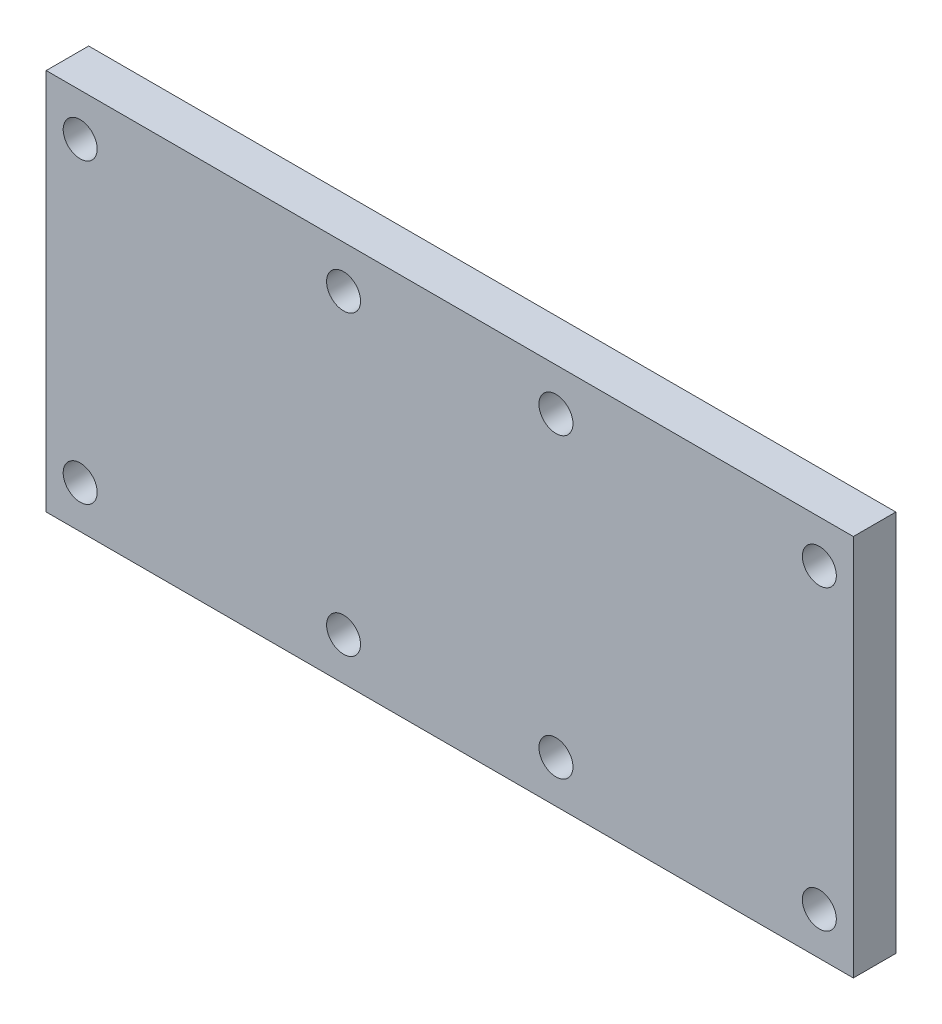
ISO-10303-21;
HEADER;
FILE_DESCRIPTION(('STEP AP214'),'2;1');
FILE_NAME('part.step','',(''),(''),'','','');
FILE_SCHEMA(('AUTOMOTIVE_DESIGN { 1 0 10303 214 1 1 1 1 }'));
ENDSEC;
DATA;
#1=APPLICATION_CONTEXT('core data for automotive mechanical design processes');
#2=APPLICATION_PROTOCOL_DEFINITION('international standard','automotive_design',2000,#1);
#3=PRODUCT_CONTEXT('',#1,'mechanical');
#4=PRODUCT('Part','Part','',(#3));
#5=PRODUCT_RELATED_PRODUCT_CATEGORY('part','',(#4));
#6=PRODUCT_DEFINITION_FORMATION('','',#4);
#7=PRODUCT_DEFINITION_CONTEXT('part definition',#1,'design');
#8=PRODUCT_DEFINITION('design','',#6,#7);
#9=PRODUCT_DEFINITION_SHAPE('','',#8);
#10=(LENGTH_UNIT() NAMED_UNIT(*) SI_UNIT(.MILLI.,.METRE.));
#11=(NAMED_UNIT(*) PLANE_ANGLE_UNIT() SI_UNIT($,.RADIAN.));
#12=(NAMED_UNIT(*) SI_UNIT($,.STERADIAN.) SOLID_ANGLE_UNIT());
#13=UNCERTAINTY_MEASURE_WITH_UNIT(LENGTH_MEASURE(1.E-05),#10,'distance_accuracy_value','');
#14=(GEOMETRIC_REPRESENTATION_CONTEXT(3) GLOBAL_UNCERTAINTY_ASSIGNED_CONTEXT((#13)) GLOBAL_UNIT_ASSIGNED_CONTEXT((#10,
#11,#12)) REPRESENTATION_CONTEXT('',''));
#15=CARTESIAN_POINT('',(0.,0.,0.));
#16=DIRECTION('',(0.,0.,1.));
#17=DIRECTION('',(1.,0.,0.));
#18=AXIS2_PLACEMENT_3D('',#15,#16,#17);
#19=CARTESIAN_POINT('',(47.5,22.5,5.));
#20=DIRECTION('',(-1.,0.,0.));
#21=DIRECTION('',(0.,-1.,0.));
#22=AXIS2_PLACEMENT_3D('',#19,#20,#21);
#23=PLANE('',#22);
#24=DIRECTION('',(0.,1.,0.));
#25=VECTOR('',#24,1.);
#26=CARTESIAN_POINT('',(47.5,22.5,0.));
#27=LINE('',#26,#25);
#28=CARTESIAN_POINT('',(47.5,-22.5,0.));
#29=VERTEX_POINT('',#28);
#30=CARTESIAN_POINT('',(47.5,22.5,0.));
#31=VERTEX_POINT('',#30);
#32=EDGE_CURVE('E97',#29,#31,#27,.T.);
#33=ORIENTED_EDGE('',*,*,#32,.T.);
#34=DIRECTION('',(0.,0.,-1.));
#35=VECTOR('',#34,1.);
#36=CARTESIAN_POINT('',(47.5,22.5,5.));
#37=LINE('',#36,#35);
#38=CARTESIAN_POINT('',(47.5,22.5,5.));
#39=VERTEX_POINT('',#38);
#40=EDGE_CURVE('E11',#39,#31,#37,.T.);
#41=ORIENTED_EDGE('',*,*,#40,.F.);
#42=DIRECTION('',(0.,1.,0.));
#43=VECTOR('',#42,1.);
#44=CARTESIAN_POINT('',(47.5,22.5,5.));
#45=LINE('',#44,#43);
#46=CARTESIAN_POINT('',(47.5,-22.5,5.));
#47=VERTEX_POINT('',#46);
#48=EDGE_CURVE('E85',#47,#39,#45,.T.);
#49=ORIENTED_EDGE('',*,*,#48,.F.);
#50=DIRECTION('',(0.,0.,-1.));
#51=VECTOR('',#50,1.);
#52=CARTESIAN_POINT('',(47.5,-22.5,5.));
#53=LINE('',#52,#51);
#54=EDGE_CURVE('E93',#47,#29,#53,.T.);
#55=ORIENTED_EDGE('',*,*,#54,.T.);
#56=EDGE_LOOP('',(#33,#41,#49,#55));
#57=FACE_BOUND('',#56,.T.);
#58=ADVANCED_FACE('F34',(#57),#23,.F.);
#59=CARTESIAN_POINT('',(-47.5,22.5,5.));
#60=DIRECTION('',(0.,-1.,0.));
#61=DIRECTION('',(0.,0.,-1.));
#62=AXIS2_PLACEMENT_3D('',#59,#60,#61);
#63=PLANE('',#62);
#64=DIRECTION('',(-1.,0.,0.));
#65=VECTOR('',#64,1.);
#66=CARTESIAN_POINT('',(-47.5,22.5,0.));
#67=LINE('',#66,#65);
#68=CARTESIAN_POINT('',(-47.5,22.5,0.));
#69=VERTEX_POINT('',#68);
#70=EDGE_CURVE('E89',#31,#69,#67,.T.);
#71=ORIENTED_EDGE('',*,*,#70,.T.);
#72=DIRECTION('',(0.,0.,-1.));
#73=VECTOR('',#72,1.);
#74=CARTESIAN_POINT('',(-47.5,22.5,5.));
#75=LINE('',#74,#73);
#76=CARTESIAN_POINT('',(-47.5,22.5,5.));
#77=VERTEX_POINT('',#76);
#78=EDGE_CURVE('E42',#77,#69,#75,.T.);
#79=ORIENTED_EDGE('',*,*,#78,.F.);
#80=DIRECTION('',(-1.,0.,0.));
#81=VECTOR('',#80,1.);
#82=CARTESIAN_POINT('',(-47.5,22.5,5.));
#83=LINE('',#82,#81);
#84=EDGE_CURVE('E80',#39,#77,#83,.T.);
#85=ORIENTED_EDGE('',*,*,#84,.F.);
#86=ORIENTED_EDGE('',*,*,#40,.T.);
#87=EDGE_LOOP('',(#71,#79,#85,#86));
#88=FACE_BOUND('',#87,.T.);
#89=ADVANCED_FACE('F88',(#88),#63,.F.);
#90=CARTESIAN_POINT('',(-47.5,22.5,5.));
#91=DIRECTION('',(1.,0.,0.));
#92=DIRECTION('',(0.,1.,0.));
#93=AXIS2_PLACEMENT_3D('',#90,#91,#92);
#94=PLANE('',#93);
#95=DIRECTION('',(0.,-1.,0.));
#96=VECTOR('',#95,1.);
#97=CARTESIAN_POINT('',(-47.5,22.5,0.));
#98=LINE('',#97,#96);
#99=CARTESIAN_POINT('',(-47.5,-22.5,0.));
#100=VERTEX_POINT('',#99);
#101=EDGE_CURVE('E67',#69,#100,#98,.T.);
#102=ORIENTED_EDGE('',*,*,#101,.T.);
#103=DIRECTION('',(0.,0.,-1.));
#104=VECTOR('',#103,1.);
#105=CARTESIAN_POINT('',(-47.5,-22.5,5.));
#106=LINE('',#105,#104);
#107=CARTESIAN_POINT('',(-47.5,-22.5,5.));
#108=VERTEX_POINT('',#107);
#109=EDGE_CURVE('E90',#108,#100,#106,.T.);
#110=ORIENTED_EDGE('',*,*,#109,.F.);
#111=DIRECTION('',(0.,-1.,0.));
#112=VECTOR('',#111,1.);
#113=CARTESIAN_POINT('',(-47.5,22.5,5.));
#114=LINE('',#113,#112);
#115=EDGE_CURVE('E83',#77,#108,#114,.T.);
#116=ORIENTED_EDGE('',*,*,#115,.F.);
#117=ORIENTED_EDGE('',*,*,#78,.T.);
#118=EDGE_LOOP('',(#102,#110,#116,#117));
#119=FACE_BOUND('',#118,.T.);
#120=ADVANCED_FACE('F91',(#119),#94,.F.);
#121=CARTESIAN_POINT('',(-47.5,-22.5,5.));
#122=DIRECTION('',(0.,1.,0.));
#123=DIRECTION('',(0.,0.,1.));
#124=AXIS2_PLACEMENT_3D('',#121,#122,#123);
#125=PLANE('',#124);
#126=DIRECTION('',(1.,0.,0.));
#127=VECTOR('',#126,1.);
#128=CARTESIAN_POINT('',(-47.5,-22.5,0.));
#129=LINE('',#128,#127);
#130=EDGE_CURVE('E73',#100,#29,#129,.T.);
#131=ORIENTED_EDGE('',*,*,#130,.T.);
#132=ORIENTED_EDGE('',*,*,#54,.F.);
#133=DIRECTION('',(1.,0.,0.));
#134=VECTOR('',#133,1.);
#135=CARTESIAN_POINT('',(-47.5,-22.5,5.));
#136=LINE('',#135,#134);
#137=EDGE_CURVE('E50',#108,#47,#136,.T.);
#138=ORIENTED_EDGE('',*,*,#137,.F.);
#139=ORIENTED_EDGE('',*,*,#109,.T.);
#140=EDGE_LOOP('',(#131,#132,#138,#139));
#141=FACE_BOUND('',#140,.T.);
#142=ADVANCED_FACE('F105',(#141),#125,.F.);
#143=CARTESIAN_POINT('',(0.,0.,5.));
#144=DIRECTION('',(0.,0.,1.));
#145=DIRECTION('',(1.,0.,0.));
#146=AXIS2_PLACEMENT_3D('',#143,#144,#145);
#147=PLANE('',#146);
#148=CARTESIAN_POINT('',(43.5,-17.5,5.));
#149=DIRECTION('',(0.,0.,1.));
#150=DIRECTION('',(1.,0.,0.));
#151=AXIS2_PLACEMENT_3D('',#148,#149,#150);
#152=CIRCLE('',#151,2.00000000000001);
#153=CARTESIAN_POINT('',(45.5,-17.5,5.));
#154=VERTEX_POINT('',#153);
#155=EDGE_CURVE('E136',#154,#154,#152,.T.);
#156=ORIENTED_EDGE('',*,*,#155,.F.);
#157=EDGE_LOOP('',(#156));
#158=FACE_BOUND('',#157,.T.);
#159=CARTESIAN_POINT('',(12.5,-17.5,5.));
#160=DIRECTION('',(0.,0.,1.));
#161=DIRECTION('',(1.,0.,0.));
#162=AXIS2_PLACEMENT_3D('',#159,#160,#161);
#163=CIRCLE('',#162,2.);
#164=CARTESIAN_POINT('',(14.5,-17.5,5.));
#165=VERTEX_POINT('',#164);
#166=EDGE_CURVE('E130',#165,#165,#163,.T.);
#167=ORIENTED_EDGE('',*,*,#166,.F.);
#168=EDGE_LOOP('',(#167));
#169=FACE_BOUND('',#168,.T.);
#170=CARTESIAN_POINT('',(12.5,17.5,5.));
#171=DIRECTION('',(0.,0.,1.));
#172=DIRECTION('',(1.,0.,0.));
#173=AXIS2_PLACEMENT_3D('',#170,#171,#172);
#174=CIRCLE('',#173,2.00000000000001);
#175=CARTESIAN_POINT('',(14.5,17.5,5.));
#176=VERTEX_POINT('',#175);
#177=EDGE_CURVE('E124',#176,#176,#174,.T.);
#178=ORIENTED_EDGE('',*,*,#177,.F.);
#179=EDGE_LOOP('',(#178));
#180=FACE_BOUND('',#179,.T.);
#181=CARTESIAN_POINT('',(-12.5,17.5,5.));
#182=DIRECTION('',(0.,0.,1.));
#183=DIRECTION('',(1.,0.,0.));
#184=AXIS2_PLACEMENT_3D('',#181,#182,#183);
#185=CIRCLE('',#184,2.);
#186=CARTESIAN_POINT('',(-10.5,17.5,5.));
#187=VERTEX_POINT('',#186);
#188=EDGE_CURVE('E117',#187,#187,#185,.T.);
#189=ORIENTED_EDGE('',*,*,#188,.F.);
#190=EDGE_LOOP('',(#189));
#191=FACE_BOUND('',#190,.T.);
#192=CARTESIAN_POINT('',(-12.5,-17.5,5.));
#193=DIRECTION('',(0.,0.,1.));
#194=DIRECTION('',(1.,0.,0.));
#195=AXIS2_PLACEMENT_3D('',#192,#193,#194);
#196=CIRCLE('',#195,2.);
#197=CARTESIAN_POINT('',(-10.5,-17.5,5.));
#198=VERTEX_POINT('',#197);
#199=EDGE_CURVE('E153',#198,#198,#196,.T.);
#200=ORIENTED_EDGE('',*,*,#199,.F.);
#201=EDGE_LOOP('',(#200));
#202=FACE_BOUND('',#201,.T.);
#203=CARTESIAN_POINT('',(-43.5,-17.5,5.));
#204=DIRECTION('',(0.,0.,1.));
#205=DIRECTION('',(1.,0.,0.));
#206=AXIS2_PLACEMENT_3D('',#203,#204,#205);
#207=CIRCLE('',#206,2.);
#208=CARTESIAN_POINT('',(-41.5,-17.5,5.));
#209=VERTEX_POINT('',#208);
#210=EDGE_CURVE('E147',#209,#209,#207,.T.);
#211=ORIENTED_EDGE('',*,*,#210,.F.);
#212=EDGE_LOOP('',(#211));
#213=FACE_BOUND('',#212,.T.);
#214=CARTESIAN_POINT('',(-43.5,17.5,5.));
#215=DIRECTION('',(0.,0.,1.));
#216=DIRECTION('',(1.,0.,0.));
#217=AXIS2_PLACEMENT_3D('',#214,#215,#216);
#218=CIRCLE('',#217,2.);
#219=CARTESIAN_POINT('',(-41.5,17.5,5.));
#220=VERTEX_POINT('',#219);
#221=EDGE_CURVE('E141',#220,#220,#218,.T.);
#222=ORIENTED_EDGE('',*,*,#221,.F.);
#223=EDGE_LOOP('',(#222));
#224=FACE_BOUND('',#223,.T.);
#225=CARTESIAN_POINT('',(43.5,17.5,5.));
#226=DIRECTION('',(0.,0.,1.));
#227=DIRECTION('',(1.,0.,0.));
#228=AXIS2_PLACEMENT_3D('',#225,#226,#227);
#229=CIRCLE('',#228,2.);
#230=CARTESIAN_POINT('',(45.5,17.5,5.));
#231=VERTEX_POINT('',#230);
#232=EDGE_CURVE('E111',#231,#231,#229,.T.);
#233=ORIENTED_EDGE('',*,*,#232,.F.);
#234=EDGE_LOOP('',(#233));
#235=FACE_BOUND('',#234,.T.);
#236=ORIENTED_EDGE('',*,*,#48,.T.);
#237=ORIENTED_EDGE('',*,*,#84,.T.);
#238=ORIENTED_EDGE('',*,*,#115,.T.);
#239=ORIENTED_EDGE('',*,*,#137,.T.);
#240=EDGE_LOOP('',(#236,#237,#238,#239));
#241=FACE_BOUND('',#240,.T.);
#242=ADVANCED_FACE('F81',(#158,#169,#180,#191,#202,#213,#224,#235,#241),#147,.T.);
#243=CARTESIAN_POINT('',(0.,0.,0.));
#244=DIRECTION('',(0.,0.,1.));
#245=DIRECTION('',(1.,0.,0.));
#246=AXIS2_PLACEMENT_3D('',#243,#244,#245);
#247=PLANE('',#246);
#248=CARTESIAN_POINT('',(43.5,-17.5,0.));
#249=DIRECTION('',(0.,0.,1.));
#250=DIRECTION('',(1.,0.,0.));
#251=AXIS2_PLACEMENT_3D('',#248,#249,#250);
#252=CIRCLE('',#251,2.00000000000001);
#253=CARTESIAN_POINT('',(45.5,-17.5,0.));
#254=VERTEX_POINT('',#253);
#255=EDGE_CURVE('E114',#254,#254,#252,.T.);
#256=ORIENTED_EDGE('',*,*,#255,.T.);
#257=EDGE_LOOP('',(#256));
#258=FACE_BOUND('',#257,.T.);
#259=CARTESIAN_POINT('',(12.5,-17.5,0.));
#260=DIRECTION('',(0.,0.,1.));
#261=DIRECTION('',(1.,0.,0.));
#262=AXIS2_PLACEMENT_3D('',#259,#260,#261);
#263=CIRCLE('',#262,2.);
#264=CARTESIAN_POINT('',(14.5,-17.5,0.));
#265=VERTEX_POINT('',#264);
#266=EDGE_CURVE('E133',#265,#265,#263,.T.);
#267=ORIENTED_EDGE('',*,*,#266,.T.);
#268=EDGE_LOOP('',(#267));
#269=FACE_BOUND('',#268,.T.);
#270=CARTESIAN_POINT('',(12.5,17.5,0.));
#271=DIRECTION('',(0.,0.,1.));
#272=DIRECTION('',(1.,0.,0.));
#273=AXIS2_PLACEMENT_3D('',#270,#271,#272);
#274=CIRCLE('',#273,2.00000000000001);
#275=CARTESIAN_POINT('',(14.5,17.5,0.));
#276=VERTEX_POINT('',#275);
#277=EDGE_CURVE('E127',#276,#276,#274,.T.);
#278=ORIENTED_EDGE('',*,*,#277,.T.);
#279=EDGE_LOOP('',(#278));
#280=FACE_BOUND('',#279,.T.);
#281=CARTESIAN_POINT('',(-12.5,17.5,0.));
#282=DIRECTION('',(0.,0.,1.));
#283=DIRECTION('',(1.,0.,0.));
#284=AXIS2_PLACEMENT_3D('',#281,#282,#283);
#285=CIRCLE('',#284,2.);
#286=CARTESIAN_POINT('',(-10.5,17.5,0.));
#287=VERTEX_POINT('',#286);
#288=EDGE_CURVE('E120',#287,#287,#285,.T.);
#289=ORIENTED_EDGE('',*,*,#288,.T.);
#290=EDGE_LOOP('',(#289));
#291=FACE_BOUND('',#290,.T.);
#292=CARTESIAN_POINT('',(-12.5,-17.5,0.));
#293=DIRECTION('',(0.,0.,1.));
#294=DIRECTION('',(1.,0.,0.));
#295=AXIS2_PLACEMENT_3D('',#292,#293,#294);
#296=CIRCLE('',#295,2.);
#297=CARTESIAN_POINT('',(-10.5,-17.5,0.));
#298=VERTEX_POINT('',#297);
#299=EDGE_CURVE('E121',#298,#298,#296,.T.);
#300=ORIENTED_EDGE('',*,*,#299,.T.);
#301=EDGE_LOOP('',(#300));
#302=FACE_BOUND('',#301,.T.);
#303=CARTESIAN_POINT('',(-43.5,-17.5,0.));
#304=DIRECTION('',(0.,0.,1.));
#305=DIRECTION('',(1.,0.,0.));
#306=AXIS2_PLACEMENT_3D('',#303,#304,#305);
#307=CIRCLE('',#306,2.);
#308=CARTESIAN_POINT('',(-41.5,-17.5,0.));
#309=VERTEX_POINT('',#308);
#310=EDGE_CURVE('E150',#309,#309,#307,.T.);
#311=ORIENTED_EDGE('',*,*,#310,.T.);
#312=EDGE_LOOP('',(#311));
#313=FACE_BOUND('',#312,.T.);
#314=CARTESIAN_POINT('',(-43.5,17.5,0.));
#315=DIRECTION('',(0.,0.,1.));
#316=DIRECTION('',(1.,0.,0.));
#317=AXIS2_PLACEMENT_3D('',#314,#315,#316);
#318=CIRCLE('',#317,2.);
#319=CARTESIAN_POINT('',(-41.5,17.5,0.));
#320=VERTEX_POINT('',#319);
#321=EDGE_CURVE('E144',#320,#320,#318,.T.);
#322=ORIENTED_EDGE('',*,*,#321,.T.);
#323=EDGE_LOOP('',(#322));
#324=FACE_BOUND('',#323,.T.);
#325=CARTESIAN_POINT('',(43.5,17.5,0.));
#326=DIRECTION('',(0.,0.,1.));
#327=DIRECTION('',(1.,0.,0.));
#328=AXIS2_PLACEMENT_3D('',#325,#326,#327);
#329=CIRCLE('',#328,2.);
#330=CARTESIAN_POINT('',(45.5,17.5,0.));
#331=VERTEX_POINT('',#330);
#332=EDGE_CURVE('E100',#331,#331,#329,.T.);
#333=ORIENTED_EDGE('',*,*,#332,.T.);
#334=EDGE_LOOP('',(#333));
#335=FACE_BOUND('',#334,.T.);
#336=ORIENTED_EDGE('',*,*,#32,.F.);
#337=ORIENTED_EDGE('',*,*,#130,.F.);
#338=ORIENTED_EDGE('',*,*,#101,.F.);
#339=ORIENTED_EDGE('',*,*,#70,.F.);
#340=EDGE_LOOP('',(#336,#337,#338,#339));
#341=FACE_BOUND('',#340,.T.);
#342=ADVANCED_FACE('F108',(#258,#269,#280,#291,#302,#313,#324,#335,#341),#247,.F.);
#343=CARTESIAN_POINT('',(43.5,17.5,0.));
#344=DIRECTION('',(0.,0.,1.));
#345=DIRECTION('',(1.,0.,0.));
#346=AXIS2_PLACEMENT_3D('',#343,#344,#345);
#347=CYLINDRICAL_SURFACE('',#346,2.);
#348=ORIENTED_EDGE('',*,*,#332,.F.);
#349=EDGE_LOOP('',(#348));
#350=FACE_BOUND('',#349,.T.);
#351=ORIENTED_EDGE('',*,*,#232,.T.);
#352=EDGE_LOOP('',(#351));
#353=FACE_BOUND('',#352,.T.);
#354=ADVANCED_FACE('F179',(#350,#353),#347,.F.);
#355=CARTESIAN_POINT('',(-43.5,17.5,0.));
#356=DIRECTION('',(0.,0.,1.));
#357=DIRECTION('',(1.,0.,0.));
#358=AXIS2_PLACEMENT_3D('',#355,#356,#357);
#359=CYLINDRICAL_SURFACE('',#358,2.);
#360=ORIENTED_EDGE('',*,*,#321,.F.);
#361=EDGE_LOOP('',(#360));
#362=FACE_BOUND('',#361,.T.);
#363=ORIENTED_EDGE('',*,*,#221,.T.);
#364=EDGE_LOOP('',(#363));
#365=FACE_BOUND('',#364,.T.);
#366=ADVANCED_FACE('F181',(#362,#365),#359,.F.);
#367=CARTESIAN_POINT('',(-43.5,-17.5,0.));
#368=DIRECTION('',(0.,0.,1.));
#369=DIRECTION('',(1.,0.,0.));
#370=AXIS2_PLACEMENT_3D('',#367,#368,#369);
#371=CYLINDRICAL_SURFACE('',#370,2.);
#372=ORIENTED_EDGE('',*,*,#310,.F.);
#373=EDGE_LOOP('',(#372));
#374=FACE_BOUND('',#373,.T.);
#375=ORIENTED_EDGE('',*,*,#210,.T.);
#376=EDGE_LOOP('',(#375));
#377=FACE_BOUND('',#376,.T.);
#378=ADVANCED_FACE('F165',(#374,#377),#371,.F.);
#379=CARTESIAN_POINT('',(-12.5,-17.5,0.));
#380=DIRECTION('',(0.,0.,1.));
#381=DIRECTION('',(1.,0.,0.));
#382=AXIS2_PLACEMENT_3D('',#379,#380,#381);
#383=CYLINDRICAL_SURFACE('',#382,2.);
#384=ORIENTED_EDGE('',*,*,#299,.F.);
#385=EDGE_LOOP('',(#384));
#386=FACE_BOUND('',#385,.T.);
#387=ORIENTED_EDGE('',*,*,#199,.T.);
#388=EDGE_LOOP('',(#387));
#389=FACE_BOUND('',#388,.T.);
#390=ADVANCED_FACE('F161',(#386,#389),#383,.F.);
#391=CARTESIAN_POINT('',(-12.5,17.5,0.));
#392=DIRECTION('',(0.,0.,1.));
#393=DIRECTION('',(1.,0.,0.));
#394=AXIS2_PLACEMENT_3D('',#391,#392,#393);
#395=CYLINDRICAL_SURFACE('',#394,2.);
#396=ORIENTED_EDGE('',*,*,#288,.F.);
#397=EDGE_LOOP('',(#396));
#398=FACE_BOUND('',#397,.T.);
#399=ORIENTED_EDGE('',*,*,#188,.T.);
#400=EDGE_LOOP('',(#399));
#401=FACE_BOUND('',#400,.T.);
#402=ADVANCED_FACE('F164',(#398,#401),#395,.F.);
#403=CARTESIAN_POINT('',(12.5,17.5,0.));
#404=DIRECTION('',(0.,0.,1.));
#405=DIRECTION('',(1.,0.,0.));
#406=AXIS2_PLACEMENT_3D('',#403,#404,#405);
#407=CYLINDRICAL_SURFACE('',#406,2.00000000000001);
#408=ORIENTED_EDGE('',*,*,#277,.F.);
#409=EDGE_LOOP('',(#408));
#410=FACE_BOUND('',#409,.T.);
#411=ORIENTED_EDGE('',*,*,#177,.T.);
#412=EDGE_LOOP('',(#411));
#413=FACE_BOUND('',#412,.T.);
#414=ADVANCED_FACE('F250',(#410,#413),#407,.F.);
#415=CARTESIAN_POINT('',(12.5,-17.5,0.));
#416=DIRECTION('',(0.,0.,1.));
#417=DIRECTION('',(1.,0.,0.));
#418=AXIS2_PLACEMENT_3D('',#415,#416,#417);
#419=CYLINDRICAL_SURFACE('',#418,2.);
#420=ORIENTED_EDGE('',*,*,#266,.F.);
#421=EDGE_LOOP('',(#420));
#422=FACE_BOUND('',#421,.T.);
#423=ORIENTED_EDGE('',*,*,#166,.T.);
#424=EDGE_LOOP('',(#423));
#425=FACE_BOUND('',#424,.T.);
#426=ADVANCED_FACE('F259',(#422,#425),#419,.F.);
#427=CARTESIAN_POINT('',(43.5,-17.5,0.));
#428=DIRECTION('',(0.,0.,1.));
#429=DIRECTION('',(1.,0.,0.));
#430=AXIS2_PLACEMENT_3D('',#427,#428,#429);
#431=CYLINDRICAL_SURFACE('',#430,2.00000000000001);
#432=ORIENTED_EDGE('',*,*,#255,.F.);
#433=EDGE_LOOP('',(#432));
#434=FACE_BOUND('',#433,.T.);
#435=ORIENTED_EDGE('',*,*,#155,.T.);
#436=EDGE_LOOP('',(#435));
#437=FACE_BOUND('',#436,.T.);
#438=ADVANCED_FACE('F269',(#434,#437),#431,.F.);
#439=CLOSED_SHELL('',(#58,#89,#120,#142,#242,#342,#354,#366,#378,#390,#402,#414,#426,#438));
#440=MANIFOLD_SOLID_BREP('B2',#439);
#441=ADVANCED_BREP_SHAPE_REPRESENTATION('',(#18,#440),#14);
#442=SHAPE_DEFINITION_REPRESENTATION(#9,#441);
ENDSEC;
END-ISO-10303-21;
